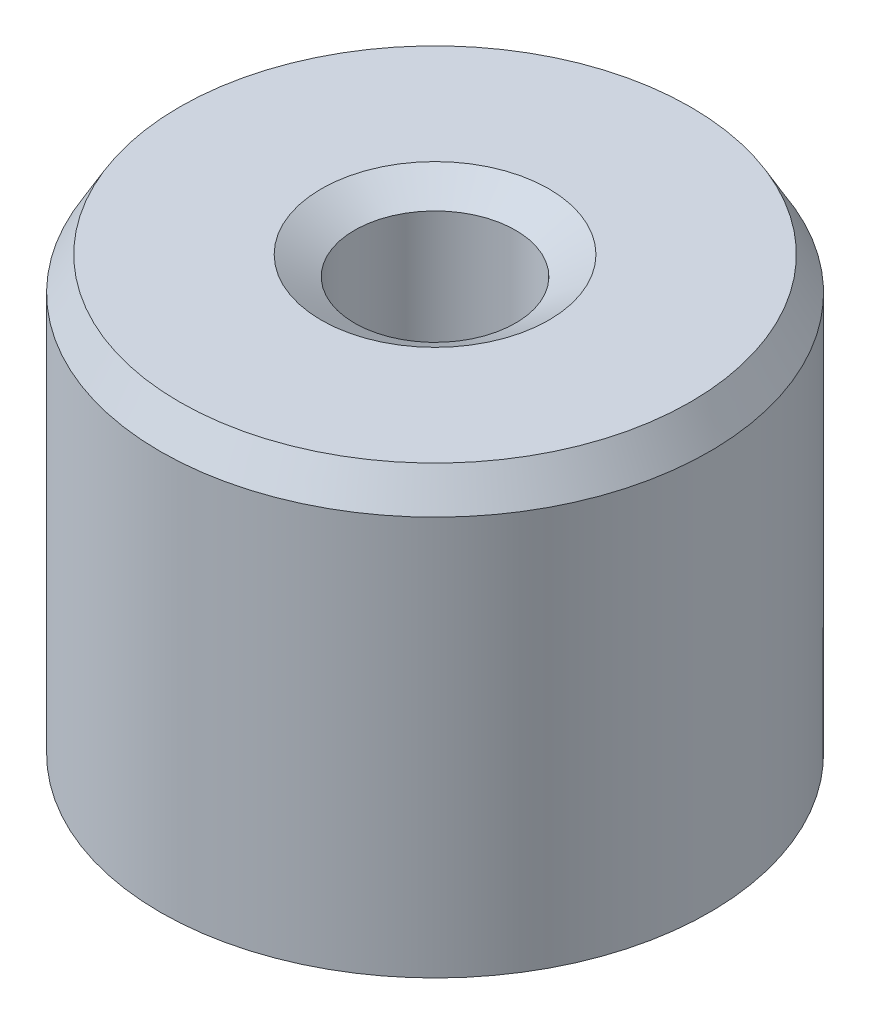
ISO-10303-21;
HEADER;
FILE_DESCRIPTION(('STEP AP214'),'2;1');
FILE_NAME('part.step','',(''),(''),'','','');
FILE_SCHEMA(('AUTOMOTIVE_DESIGN { 1 0 10303 214 1 1 1 1 }'));
ENDSEC;
DATA;
#1=APPLICATION_CONTEXT('core data for automotive mechanical design processes');
#2=APPLICATION_PROTOCOL_DEFINITION('international standard','automotive_design',2000,#1);
#3=PRODUCT_CONTEXT('',#1,'mechanical');
#4=PRODUCT('Part','Part','',(#3));
#5=PRODUCT_RELATED_PRODUCT_CATEGORY('part','',(#4));
#6=PRODUCT_DEFINITION_FORMATION('','',#4);
#7=PRODUCT_DEFINITION_CONTEXT('part definition',#1,'design');
#8=PRODUCT_DEFINITION('design','',#6,#7);
#9=PRODUCT_DEFINITION_SHAPE('','',#8);
#10=(LENGTH_UNIT() NAMED_UNIT(*) SI_UNIT(.MILLI.,.METRE.));
#11=(NAMED_UNIT(*) PLANE_ANGLE_UNIT() SI_UNIT($,.RADIAN.));
#12=(NAMED_UNIT(*) SI_UNIT($,.STERADIAN.) SOLID_ANGLE_UNIT());
#13=UNCERTAINTY_MEASURE_WITH_UNIT(LENGTH_MEASURE(1.E-05),#10,'distance_accuracy_value','');
#14=(GEOMETRIC_REPRESENTATION_CONTEXT(3) GLOBAL_UNCERTAINTY_ASSIGNED_CONTEXT((#13)) GLOBAL_UNIT_ASSIGNED_CONTEXT((#10,
#11,#12)) REPRESENTATION_CONTEXT('',''));
#15=CARTESIAN_POINT('',(0.,0.,0.));
#16=DIRECTION('',(0.,0.,1.));
#17=DIRECTION('',(1.,0.,0.));
#18=AXIS2_PLACEMENT_3D('',#15,#16,#17);
#19=CARTESIAN_POINT('',(0.,8.21848775719892,0.));
#20=DIRECTION('',(0.,-1.,0.));
#21=DIRECTION('',(0.,0.,-1.));
#22=AXIS2_PLACEMENT_3D('',#19,#20,#21);
#23=CYLINDRICAL_SURFACE('',#22,5.);
#24=CARTESIAN_POINT('',(0.,0.349629665588758,0.));
#25=DIRECTION('',(0.,1.,0.));
#26=DIRECTION('',(0.,0.,1.));
#27=AXIS2_PLACEMENT_3D('',#24,#25,#26);
#28=CIRCLE('',#27,5.);
#29=CARTESIAN_POINT('',(0.,0.349629665588758,5.));
#30=VERTEX_POINT('',#29);
#31=EDGE_CURVE('E10',#30,#30,#28,.T.);
#32=ORIENTED_EDGE('',*,*,#31,.T.);
#33=EDGE_LOOP('',(#32));
#34=FACE_BOUND('',#33,.T.);
#35=CARTESIAN_POINT('',(0.,7.61291141256587,0.));
#36=DIRECTION('',(0.,1.,0.));
#37=DIRECTION('',(0.,0.,1.));
#38=AXIS2_PLACEMENT_3D('',#35,#36,#37);
#39=CIRCLE('',#38,5.);
#40=CARTESIAN_POINT('',(0.,7.61291141256587,5.));
#41=VERTEX_POINT('',#40);
#42=EDGE_CURVE('E50',#41,#41,#39,.F.);
#43=ORIENTED_EDGE('',*,*,#42,.T.);
#44=EDGE_LOOP('',(#43));
#45=FACE_BOUND('',#44,.T.);
#46=ADVANCED_FACE('F39',(#34,#45),#23,.T.);
#47=CARTESIAN_POINT('',(0.,8.21848775719892,0.));
#48=DIRECTION('',(0.,1.,0.));
#49=DIRECTION('',(0.,0.,1.));
#50=AXIS2_PLACEMENT_3D('',#47,#48,#49);
#51=PLANE('',#50);
#52=CARTESIAN_POINT('',(0.,8.21848775719892,0.));
#53=DIRECTION('',(0.,1.,0.));
#54=DIRECTION('',(0.,0.,1.));
#55=AXIS2_PLACEMENT_3D('',#52,#53,#54);
#56=CIRCLE('',#55,2.07103458034683);
#57=CARTESIAN_POINT('',(0.,8.21848775719892,2.07103458034683));
#58=VERTEX_POINT('',#57);
#59=EDGE_CURVE('E58',#58,#58,#56,.F.);
#60=ORIENTED_EDGE('',*,*,#59,.T.);
#61=EDGE_LOOP('',(#60));
#62=FACE_BOUND('',#61,.T.);
#63=CARTESIAN_POINT('',(0.,8.21848775719892,0.));
#64=DIRECTION('',(0.,1.,0.));
#65=DIRECTION('',(0.,0.,1.));
#66=AXIS2_PLACEMENT_3D('',#63,#64,#65);
#67=CIRCLE('',#66,4.65037033441124);
#68=CARTESIAN_POINT('',(0.,8.21848775719892,4.65037033441124));
#69=VERTEX_POINT('',#68);
#70=EDGE_CURVE('E61',#69,#69,#67,.T.);
#71=ORIENTED_EDGE('',*,*,#70,.T.);
#72=EDGE_LOOP('',(#71));
#73=FACE_BOUND('',#72,.T.);
#74=ADVANCED_FACE('F88',(#62,#73),#51,.T.);
#75=CARTESIAN_POINT('',(0.,0.,0.));
#76=DIRECTION('',(0.,1.,0.));
#77=DIRECTION('',(0.,0.,1.));
#78=AXIS2_PLACEMENT_3D('',#75,#76,#77);
#79=PLANE('',#78);
#80=CARTESIAN_POINT('',(0.,0.,0.));
#81=DIRECTION('',(0.,1.,0.));
#82=DIRECTION('',(0.,0.,1.));
#83=AXIS2_PLACEMENT_3D('',#80,#81,#82);
#84=CIRCLE('',#83,1.81508790130254);
#85=CARTESIAN_POINT('',(0.,0.,1.81508790130254));
#86=VERTEX_POINT('',#85);
#87=EDGE_CURVE('E51',#86,#86,#84,.T.);
#88=ORIENTED_EDGE('',*,*,#87,.T.);
#89=EDGE_LOOP('',(#88));
#90=FACE_BOUND('',#89,.T.);
#91=CARTESIAN_POINT('',(0.,0.,0.));
#92=DIRECTION('',(0.,1.,0.));
#93=DIRECTION('',(0.,0.,1.));
#94=AXIS2_PLACEMENT_3D('',#91,#92,#93);
#95=CIRCLE('',#94,4.39442365536695);
#96=CARTESIAN_POINT('',(0.,0.,4.39442365536695));
#97=VERTEX_POINT('',#96);
#98=EDGE_CURVE('E54',#97,#97,#95,.F.);
#99=ORIENTED_EDGE('',*,*,#98,.T.);
#100=EDGE_LOOP('',(#99));
#101=FACE_BOUND('',#100,.T.);
#102=ADVANCED_FACE('F83',(#90,#101),#79,.F.);
#103=CARTESIAN_POINT('',(0.,8.21848775719892,0.));
#104=DIRECTION('',(0.,-1.,0.));
#105=DIRECTION('',(0.,0.,-1.));
#106=AXIS2_PLACEMENT_3D('',#103,#104,#105);
#107=CYLINDRICAL_SURFACE('',#106,1.46545823571378);
#108=CARTESIAN_POINT('',(0.,7.86885809161016,0.));
#109=DIRECTION('',(0.,1.,0.));
#110=DIRECTION('',(0.,0.,1.));
#111=AXIS2_PLACEMENT_3D('',#108,#109,#110);
#112=CIRCLE('',#111,1.46545823571378);
#113=CARTESIAN_POINT('',(0.,7.86885809161016,1.46545823571378));
#114=VERTEX_POINT('',#113);
#115=EDGE_CURVE('E67',#114,#114,#112,.T.);
#116=ORIENTED_EDGE('',*,*,#115,.T.);
#117=EDGE_LOOP('',(#116));
#118=FACE_BOUND('',#117,.T.);
#119=CARTESIAN_POINT('',(0.,0.605576344633048,0.));
#120=DIRECTION('',(0.,1.,0.));
#121=DIRECTION('',(0.,0.,1.));
#122=AXIS2_PLACEMENT_3D('',#119,#120,#121);
#123=CIRCLE('',#122,1.46545823571378);
#124=CARTESIAN_POINT('',(0.,0.605576344633048,1.46545823571378));
#125=VERTEX_POINT('',#124);
#126=EDGE_CURVE('E69',#125,#125,#123,.F.);
#127=ORIENTED_EDGE('',*,*,#126,.T.);
#128=EDGE_LOOP('',(#127));
#129=FACE_BOUND('',#128,.T.);
#130=ADVANCED_FACE('F71',(#118,#129),#107,.F.);
#131=CARTESIAN_POINT('',(0.,7.86885809161016,0.));
#132=DIRECTION('',(0.,1.,0.));
#133=DIRECTION('',(0.,0.,1.));
#134=AXIS2_PLACEMENT_3D('',#131,#132,#133);
#135=CONICAL_SURFACE('',#134,1.46545823571378,1.0471975511966);
#136=CARTESIAN_POINT('',(0.,8.21848775719892,2.07103458034683));
#137=CARTESIAN_POINT('',(0.,8.21484578151571,2.06472649342357));
#138=CARTESIAN_POINT('',(0.,8.21120380583249,2.05841840650031));
#139=CARTESIAN_POINT('',(0.,8.20391985446606,2.04580223265379));
#140=CARTESIAN_POINT('',(0.,8.20027787878284,2.03949414573053));
#141=CARTESIAN_POINT('',(0.,8.19299392741641,2.026877971884));
#142=CARTESIAN_POINT('',(0.,8.18935195173319,2.02056988496074));
#143=CARTESIAN_POINT('',(0.,8.18206800036676,2.00795371111422));
#144=CARTESIAN_POINT('',(0.,8.17842602468354,2.00164562419096));
#145=CARTESIAN_POINT('',(0.,8.17114207331711,1.98902945034444));
#146=CARTESIAN_POINT('',(0.,8.16750009763389,1.98272136342118));
#147=CARTESIAN_POINT('',(0.,8.16021614626746,1.97010518957466));
#148=CARTESIAN_POINT('',(0.,8.15657417058424,1.9637971026514));
#149=CARTESIAN_POINT('',(0.,8.14929021921781,1.95118092880487));
#150=CARTESIAN_POINT('',(0.,8.1456482435346,1.94487284188161));
#151=CARTESIAN_POINT('',(0.,8.13836429216817,1.93225666803509));
#152=CARTESIAN_POINT('',(0.,8.13472231648495,1.92594858111183));
#153=CARTESIAN_POINT('',(0.,8.12743836511852,1.91333240726531));
#154=CARTESIAN_POINT('',(0.,8.1237963894353,1.90702432034205));
#155=CARTESIAN_POINT('',(0.,8.11651243806887,1.89440814649553));
#156=CARTESIAN_POINT('',(0.,8.11287046238565,1.88810005957226));
#157=CARTESIAN_POINT('',(0.,8.10558651101922,1.87548388572574));
#158=CARTESIAN_POINT('',(0.,8.101944535336,1.86917579880248));
#159=CARTESIAN_POINT('',(0.,8.09466058396957,1.85655962495596));
#160=CARTESIAN_POINT('',(0.,8.09101860828635,1.8502515380327));
#161=CARTESIAN_POINT('',(0.,8.08373465691992,1.83763536418618));
#162=CARTESIAN_POINT('',(0.,8.0800926812367,1.83132727726292));
#163=CARTESIAN_POINT('',(0.,8.07280872987027,1.81871110341639));
#164=CARTESIAN_POINT('',(0.,8.06916675418706,1.81240301649313));
#165=CARTESIAN_POINT('',(0.,8.06188280282062,1.79978684264661));
#166=CARTESIAN_POINT('',(0.,8.05824082713741,1.79347875572335));
#167=CARTESIAN_POINT('',(0.,8.05095687577098,1.78086258187683));
#168=CARTESIAN_POINT('',(0.,8.04731490008776,1.77455449495357));
#169=CARTESIAN_POINT('',(0.,8.04003094872133,1.76193832110705));
#170=CARTESIAN_POINT('',(0.,8.03638897303811,1.75563023418378));
#171=CARTESIAN_POINT('',(0.,8.02910502167168,1.74301406033726));
#172=CARTESIAN_POINT('',(0.,8.02546304598846,1.736705973414));
#173=CARTESIAN_POINT('',(0.,8.01817909462203,1.72408979956748));
#174=CARTESIAN_POINT('',(0.,8.01453711893881,1.71778171264422));
#175=CARTESIAN_POINT('',(0.,8.00725316757238,1.7051655387977));
#176=CARTESIAN_POINT('',(0.,8.00361119188916,1.69885745187444));
#177=CARTESIAN_POINT('',(0.,7.99632724052273,1.68624127802791));
#178=CARTESIAN_POINT('',(0.,7.99268526483952,1.67993319110465));
#179=CARTESIAN_POINT('',(0.,7.98540131347308,1.66731701725813));
#180=CARTESIAN_POINT('',(0.,7.98175933778987,1.66100893033487));
#181=CARTESIAN_POINT('',(0.,7.97447538642343,1.64839275648835));
#182=CARTESIAN_POINT('',(0.,7.97083341074022,1.64208466956509));
#183=CARTESIAN_POINT('',(0.,7.96354945937378,1.62946849571857));
#184=CARTESIAN_POINT('',(0.,7.95990748369057,1.62316040879531));
#185=CARTESIAN_POINT('',(0.,7.95262353232413,1.61054423494878));
#186=CARTESIAN_POINT('',(0.,7.94898155664092,1.60423614802552));
#187=CARTESIAN_POINT('',(0.,7.94169760527449,1.591619974179));
#188=CARTESIAN_POINT('',(0.,7.93805562959127,1.58531188725574));
#189=CARTESIAN_POINT('',(0.,7.93077167822484,1.57269571340922));
#190=CARTESIAN_POINT('',(0.,7.92712970254162,1.56638762648596));
#191=CARTESIAN_POINT('',(0.,7.91984575117519,1.55377145263944));
#192=CARTESIAN_POINT('',(0.,7.91620377549197,1.54746336571617));
#193=CARTESIAN_POINT('',(0.,7.90891982412554,1.53484719186965));
#194=CARTESIAN_POINT('',(0.,7.90527784844233,1.52853910494639));
#195=CARTESIAN_POINT('',(0.,7.89799389707589,1.51592293109987));
#196=CARTESIAN_POINT('',(0.,7.89435192139268,1.50961484417661));
#197=CARTESIAN_POINT('',(0.,7.88706797002624,1.49699867033009));
#198=CARTESIAN_POINT('',(0.,7.88342599434303,1.49069058340683));
#199=CARTESIAN_POINT('',(0.,7.87614204297659,1.4780744095603));
#200=CARTESIAN_POINT('',(0.,7.87250006729338,1.47176632263704));
#201=CARTESIAN_POINT('',(0.,7.86885809161016,1.46545823571378));
#202=B_SPLINE_CURVE_WITH_KNOTS('',3,(#136,#137,#138,#139,#140,#141,#142,#143,#144,#145,#146,
#147,#148,#149,#150,#151,#152,#153,#154,#155,#156,#157,#158,#159,#160,#161,#162,#163,#164,#165,
#166,#167,#168,#169,#170,#171,#172,#173,#174,#175,#176,#177,#178,#179,#180,#181,#182,#183,#184,
#185,#186,#187,#188,#189,#190,#191,#192,#193,#194,#195,#196,#197,#198,#199,#200,#201),
.UNSPECIFIED.,.F.,.F.,(4,2,2,2,2,2,2,2,2,2,2,2,2,2,2,2,2,2,2,2,2,2,2,2,2,2,2,2,2,2,2,2,4),(0.,
0.0218518540992978,0.0437037081985953,0.0655555622978931,0.0874074163971905,0.109259270496488,
0.131111124595786,0.152962978695083,0.17481483279438,0.196666686893678,0.218518540992976,
0.240370395092273,0.262222249191571,0.284074103290868,0.305925957390165,0.327777811489463,
0.349629665588761,0.371481519688058,0.393333373787356,0.415185227886654,0.43703708198595,
0.458888936085248,0.480740790184546,0.502592644283843,0.524444498383141,0.546296352482439,
0.568148206581735,0.590000060681033,0.611851914780331,0.633703768879628,0.655555622978926,
0.677407477078224,0.69925933117752),.UNSPECIFIED.);
#203=EDGE_CURVE('BSEAM77',#58,#114,#202,.T.);
#204=ORIENTED_EDGE('',*,*,#59,.F.);
#205=ORIENTED_EDGE('',*,*,#115,.F.);
#206=ORIENTED_EDGE('',*,*,#203,.T.);
#207=ORIENTED_EDGE('',*,*,#203,.F.);
#208=EDGE_LOOP('',(#204,#206,#205,#207));
#209=FACE_BOUND('',#208,.T.);
#210=ADVANCED_FACE('F77',(#209),#135,.F.);
#211=CARTESIAN_POINT('',(0.,0.,0.));
#212=DIRECTION('',(0.,-1.,0.));
#213=DIRECTION('',(0.,0.,-1.));
#214=AXIS2_PLACEMENT_3D('',#211,#212,#213);
#215=CONICAL_SURFACE('',#214,1.81508790130254,0.523598775598295);
#216=ORIENTED_EDGE('',*,*,#126,.F.);
#217=EDGE_LOOP('',(#216));
#218=FACE_BOUND('',#217,.T.);
#219=ORIENTED_EDGE('',*,*,#87,.F.);
#220=EDGE_LOOP('',(#219));
#221=FACE_BOUND('',#220,.T.);
#222=ADVANCED_FACE('F73',(#218,#221),#215,.F.);
#223=CARTESIAN_POINT('',(0.,0.349629665588758,0.));
#224=DIRECTION('',(0.,1.,0.));
#225=DIRECTION('',(0.,0.,1.));
#226=AXIS2_PLACEMENT_3D('',#223,#224,#225);
#227=CONICAL_SURFACE('',#226,5.,1.0471975511966);
#228=ORIENTED_EDGE('',*,*,#98,.F.);
#229=EDGE_LOOP('',(#228));
#230=FACE_BOUND('',#229,.T.);
#231=ORIENTED_EDGE('',*,*,#31,.F.);
#232=EDGE_LOOP('',(#231));
#233=FACE_BOUND('',#232,.T.);
#234=ADVANCED_FACE('F76',(#230,#233),#227,.T.);
#235=CARTESIAN_POINT('',(0.,8.21848775719892,0.));
#236=DIRECTION('',(0.,-1.,0.));
#237=DIRECTION('',(0.,0.,-1.));
#238=AXIS2_PLACEMENT_3D('',#235,#236,#237);
#239=CONICAL_SURFACE('',#238,4.65037033441124,0.523598775598295);
#240=ORIENTED_EDGE('',*,*,#42,.F.);
#241=EDGE_LOOP('',(#240));
#242=FACE_BOUND('',#241,.T.);
#243=ORIENTED_EDGE('',*,*,#70,.F.);
#244=EDGE_LOOP('',(#243));
#245=FACE_BOUND('',#244,.T.);
#246=ADVANCED_FACE('F45',(#242,#245),#239,.T.);
#247=CLOSED_SHELL('',(#46,#74,#102,#130,#210,#222,#234,#246));
#248=MANIFOLD_SOLID_BREP('B2',#247);
#249=ADVANCED_BREP_SHAPE_REPRESENTATION('',(#18,#248),#14);
#250=SHAPE_DEFINITION_REPRESENTATION(#9,#249);
ENDSEC;
END-ISO-10303-21;
